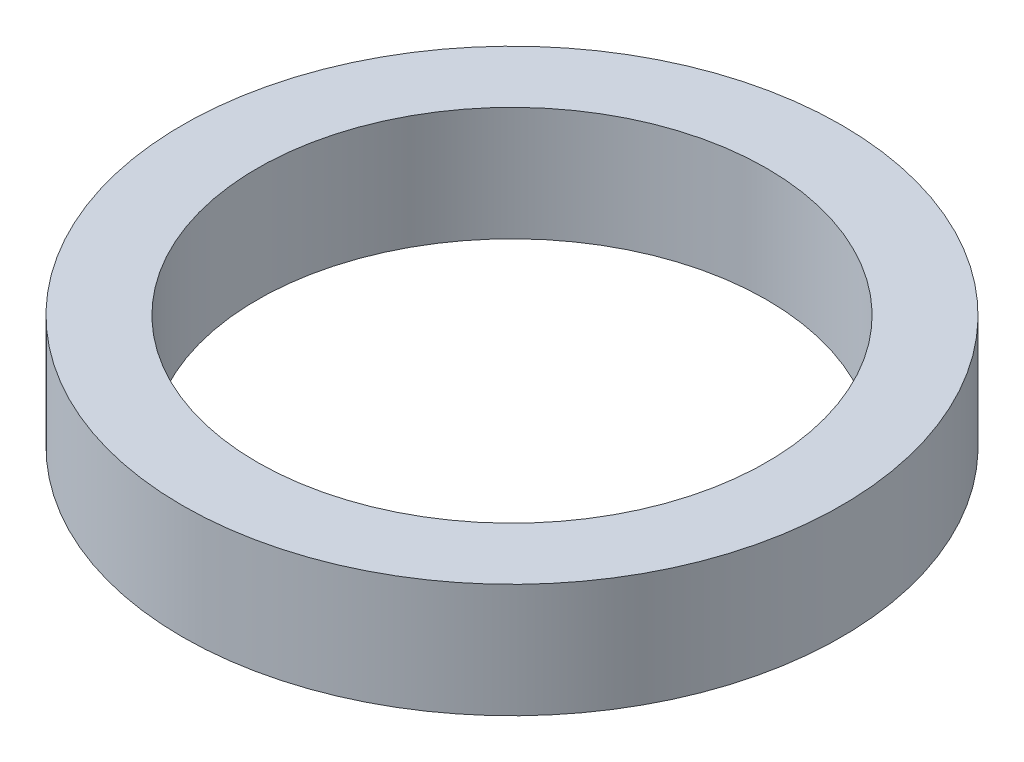
ISO-10303-21;
HEADER;
FILE_DESCRIPTION(('STEP AP214'),'2;1');
FILE_NAME('part.step','',(''),(''),'','','');
FILE_SCHEMA(('AUTOMOTIVE_DESIGN { 1 0 10303 214 1 1 1 1 }'));
ENDSEC;
DATA;
#1=APPLICATION_CONTEXT('core data for automotive mechanical design processes');
#2=APPLICATION_PROTOCOL_DEFINITION('international standard','automotive_design',2000,#1);
#3=PRODUCT_CONTEXT('',#1,'mechanical');
#4=PRODUCT('Part','Part','',(#3));
#5=PRODUCT_RELATED_PRODUCT_CATEGORY('part','',(#4));
#6=PRODUCT_DEFINITION_FORMATION('','',#4);
#7=PRODUCT_DEFINITION_CONTEXT('part definition',#1,'design');
#8=PRODUCT_DEFINITION('design','',#6,#7);
#9=PRODUCT_DEFINITION_SHAPE('','',#8);
#10=(LENGTH_UNIT() NAMED_UNIT(*) SI_UNIT(.MILLI.,.METRE.));
#11=(NAMED_UNIT(*) PLANE_ANGLE_UNIT() SI_UNIT($,.RADIAN.));
#12=(NAMED_UNIT(*) SI_UNIT($,.STERADIAN.) SOLID_ANGLE_UNIT());
#13=UNCERTAINTY_MEASURE_WITH_UNIT(LENGTH_MEASURE(1.E-05),#10,'distance_accuracy_value','');
#14=(GEOMETRIC_REPRESENTATION_CONTEXT(3) GLOBAL_UNCERTAINTY_ASSIGNED_CONTEXT((#13)) GLOBAL_UNIT_ASSIGNED_CONTEXT((#10,
#11,#12)) REPRESENTATION_CONTEXT('',''));
#15=CARTESIAN_POINT('',(0.,0.,0.));
#16=DIRECTION('',(0.,0.,1.));
#17=DIRECTION('',(1.,0.,0.));
#18=AXIS2_PLACEMENT_3D('',#15,#16,#17);
#19=CARTESIAN_POINT('',(0.,19.,0.));
#20=DIRECTION('',(0.,-1.,0.));
#21=DIRECTION('',(0.,0.,-1.));
#22=AXIS2_PLACEMENT_3D('',#19,#20,#21);
#23=CYLINDRICAL_SURFACE('',#22,55.);
#24=CARTESIAN_POINT('',(0.,19.,0.));
#25=DIRECTION('',(0.,1.,0.));
#26=DIRECTION('',(0.,0.,1.));
#27=AXIS2_PLACEMENT_3D('',#24,#25,#26);
#28=CIRCLE('',#27,55.);
#29=CARTESIAN_POINT('',(0.,19.,55.));
#30=VERTEX_POINT('',#29);
#31=EDGE_CURVE('E10',#30,#30,#28,.T.);
#32=ORIENTED_EDGE('',*,*,#31,.F.);
#33=EDGE_LOOP('',(#32));
#34=FACE_BOUND('',#33,.T.);
#35=CARTESIAN_POINT('',(0.,0.,0.));
#36=DIRECTION('',(0.,1.,0.));
#37=DIRECTION('',(0.,0.,1.));
#38=AXIS2_PLACEMENT_3D('',#35,#36,#37);
#39=CIRCLE('',#38,55.);
#40=CARTESIAN_POINT('',(0.,0.,55.));
#41=VERTEX_POINT('',#40);
#42=EDGE_CURVE('E37',#41,#41,#39,.T.);
#43=ORIENTED_EDGE('',*,*,#42,.T.);
#44=EDGE_LOOP('',(#43));
#45=FACE_BOUND('',#44,.T.);
#46=ADVANCED_FACE('F40',(#34,#45),#23,.T.);
#47=CARTESIAN_POINT('',(0.,19.,0.));
#48=DIRECTION('',(0.,1.,0.));
#49=DIRECTION('',(0.,0.,1.));
#50=AXIS2_PLACEMENT_3D('',#47,#48,#49);
#51=PLANE('',#50);
#52=CARTESIAN_POINT('',(0.,19.,0.));
#53=DIRECTION('',(0.,1.,0.));
#54=DIRECTION('',(0.,0.,1.));
#55=AXIS2_PLACEMENT_3D('',#52,#53,#54);
#56=CIRCLE('',#55,42.5);
#57=CARTESIAN_POINT('',(0.,19.,42.5));
#58=VERTEX_POINT('',#57);
#59=EDGE_CURVE('E50',#58,#58,#56,.T.);
#60=ORIENTED_EDGE('',*,*,#59,.F.);
#61=EDGE_LOOP('',(#60));
#62=FACE_BOUND('',#61,.T.);
#63=ORIENTED_EDGE('',*,*,#31,.T.);
#64=EDGE_LOOP('',(#63));
#65=FACE_BOUND('',#64,.T.);
#66=ADVANCED_FACE('F59',(#62,#65),#51,.T.);
#67=CARTESIAN_POINT('',(0.,0.,0.));
#68=DIRECTION('',(0.,1.,0.));
#69=DIRECTION('',(0.,0.,1.));
#70=AXIS2_PLACEMENT_3D('',#67,#68,#69);
#71=PLANE('',#70);
#72=CARTESIAN_POINT('',(0.,0.,0.));
#73=DIRECTION('',(0.,1.,0.));
#74=DIRECTION('',(0.,0.,1.));
#75=AXIS2_PLACEMENT_3D('',#72,#73,#74);
#76=CIRCLE('',#75,42.5);
#77=CARTESIAN_POINT('',(0.,0.,42.5));
#78=VERTEX_POINT('',#77);
#79=EDGE_CURVE('E47',#78,#78,#76,.T.);
#80=ORIENTED_EDGE('',*,*,#79,.T.);
#81=EDGE_LOOP('',(#80));
#82=FACE_BOUND('',#81,.T.);
#83=ORIENTED_EDGE('',*,*,#42,.F.);
#84=EDGE_LOOP('',(#83));
#85=FACE_BOUND('',#84,.T.);
#86=ADVANCED_FACE('F58',(#82,#85),#71,.F.);
#87=CARTESIAN_POINT('',(0.,19.,0.));
#88=DIRECTION('',(0.,-1.,0.));
#89=DIRECTION('',(0.,0.,-1.));
#90=AXIS2_PLACEMENT_3D('',#87,#88,#89);
#91=CYLINDRICAL_SURFACE('',#90,42.5);
#92=ORIENTED_EDGE('',*,*,#59,.T.);
#93=EDGE_LOOP('',(#92));
#94=FACE_BOUND('',#93,.T.);
#95=ORIENTED_EDGE('',*,*,#79,.F.);
#96=EDGE_LOOP('',(#95));
#97=FACE_BOUND('',#96,.T.);
#98=ADVANCED_FACE('F54',(#94,#97),#91,.F.);
#99=CLOSED_SHELL('',(#46,#66,#86,#98));
#100=MANIFOLD_SOLID_BREP('B2',#99);
#101=ADVANCED_BREP_SHAPE_REPRESENTATION('',(#18,#100),#14);
#102=SHAPE_DEFINITION_REPRESENTATION(#9,#101);
ENDSEC;
END-ISO-10303-21;
